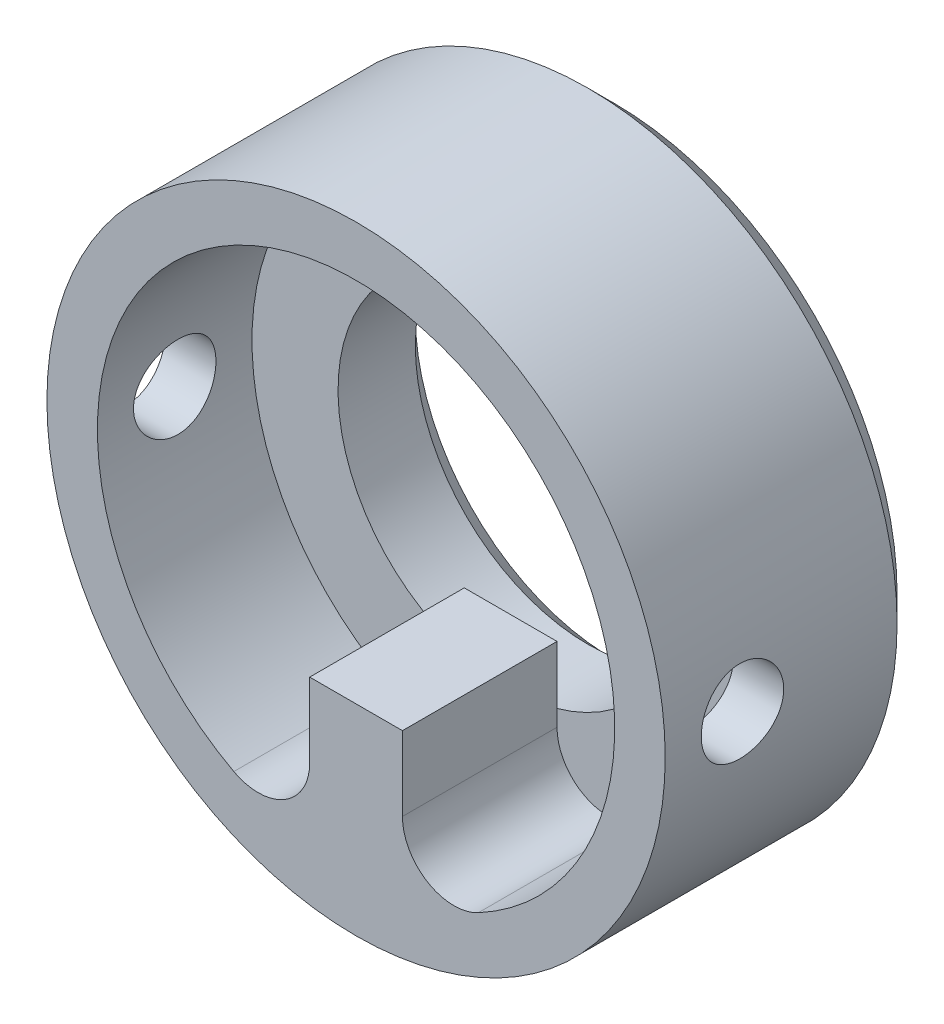
ISO-10303-21;
HEADER;
FILE_DESCRIPTION(('STEP AP214'),'2;1');
FILE_NAME('part.step','',(''),(''),'','','');
FILE_SCHEMA(('AUTOMOTIVE_DESIGN { 1 0 10303 214 1 1 1 1 }'));
ENDSEC;
DATA;
#1=APPLICATION_CONTEXT('core data for automotive mechanical design processes');
#2=APPLICATION_PROTOCOL_DEFINITION('international standard','automotive_design',2000,#1);
#3=PRODUCT_CONTEXT('',#1,'mechanical');
#4=PRODUCT('Part','Part','',(#3));
#5=PRODUCT_RELATED_PRODUCT_CATEGORY('part','',(#4));
#6=PRODUCT_DEFINITION_FORMATION('','',#4);
#7=PRODUCT_DEFINITION_CONTEXT('part definition',#1,'design');
#8=PRODUCT_DEFINITION('design','',#6,#7);
#9=PRODUCT_DEFINITION_SHAPE('','',#8);
#10=(LENGTH_UNIT() NAMED_UNIT(*) SI_UNIT(.MILLI.,.METRE.));
#11=(NAMED_UNIT(*) PLANE_ANGLE_UNIT() SI_UNIT($,.RADIAN.));
#12=(NAMED_UNIT(*) SI_UNIT($,.STERADIAN.) SOLID_ANGLE_UNIT());
#13=UNCERTAINTY_MEASURE_WITH_UNIT(LENGTH_MEASURE(1.E-05),#10,'distance_accuracy_value','');
#14=(GEOMETRIC_REPRESENTATION_CONTEXT(3) GLOBAL_UNCERTAINTY_ASSIGNED_CONTEXT((#13)) GLOBAL_UNIT_ASSIGNED_CONTEXT((#10,
#11,#12)) REPRESENTATION_CONTEXT('',''));
#15=CARTESIAN_POINT('',(0.,0.,0.));
#16=DIRECTION('',(0.,0.,1.));
#17=DIRECTION('',(1.,0.,0.));
#18=AXIS2_PLACEMENT_3D('',#15,#16,#17);
#19=CARTESIAN_POINT('',(0.,0.,0.));
#20=DIRECTION('',(0.,0.,1.));
#21=DIRECTION('',(1.,0.,0.));
#22=AXIS2_PLACEMENT_3D('',#19,#20,#21);
#23=CYLINDRICAL_SURFACE('',#22,3.35);
#24=CARTESIAN_POINT('',(0.,0.,-3.));
#25=DIRECTION('',(0.,0.,1.));
#26=DIRECTION('',(1.,0.,0.));
#27=AXIS2_PLACEMENT_3D('',#24,#25,#26);
#28=CIRCLE('',#27,3.35);
#29=CARTESIAN_POINT('',(-0.9,-3.22684056005251,-3.));
#30=VERTEX_POINT('',#29);
#31=CARTESIAN_POINT('',(0.899999999999999,-3.22684056005251,-3.));
#32=VERTEX_POINT('',#31);
#33=EDGE_CURVE('E65',#30,#32,#28,.F.);
#34=ORIENTED_EDGE('',*,*,#33,.F.);
#35=CARTESIAN_POINT('',(0.,0.,-3.));
#36=DIRECTION('',(0.,0.,1.));
#37=DIRECTION('',(1.,0.,0.));
#38=AXIS2_PLACEMENT_3D('',#35,#36,#37);
#39=CIRCLE('',#38,3.35);
#40=EDGE_CURVE('E19',#30,#32,#39,.T.);
#41=ORIENTED_EDGE('',*,*,#40,.T.);
#42=EDGE_LOOP('',(#34,#41));
#43=FACE_BOUND('',#42,.T.);
#44=CARTESIAN_POINT('',(0.,0.,-4.50000000000728));
#45=DIRECTION('',(0.,0.,-1.));
#46=DIRECTION('',(-1.,0.,0.));
#47=AXIS2_PLACEMENT_3D('',#44,#45,#46);
#48=CIRCLE('',#47,3.35000000001173);
#49=CARTESIAN_POINT('',(-3.35000000001173,0.,-4.50000000000728));
#50=VERTEX_POINT('',#49);
#51=EDGE_CURVE('E73',#50,#50,#48,.T.);
#52=ORIENTED_EDGE('',*,*,#51,.T.);
#53=EDGE_LOOP('',(#52));
#54=FACE_BOUND('',#53,.T.);
#55=ADVANCED_FACE('F16',(#43,#54),#23,.F.);
#56=CARTESIAN_POINT('',(0.,0.,-4.99999999999545));
#57=DIRECTION('',(0.,0.,-1.));
#58=DIRECTION('',(-1.,0.,0.));
#59=AXIS2_PLACEMENT_3D('',#56,#57,#58);
#60=CONICAL_SURFACE('',#59,3.84999999999991,0.785398163397448);
#61=ORIENTED_EDGE('',*,*,#51,.F.);
#62=EDGE_LOOP('',(#61));
#63=FACE_BOUND('',#62,.T.);
#64=CARTESIAN_POINT('',(0.,0.,-4.99999999999545));
#65=DIRECTION('',(0.,0.,-1.));
#66=DIRECTION('',(-1.,0.,0.));
#67=AXIS2_PLACEMENT_3D('',#64,#65,#66);
#68=CIRCLE('',#67,3.84999999999991);
#69=CARTESIAN_POINT('',(-3.84999999999991,0.,-4.99999999999545));
#70=VERTEX_POINT('',#69);
#71=EDGE_CURVE('E100',#70,#70,#68,.F.);
#72=ORIENTED_EDGE('',*,*,#71,.F.);
#73=EDGE_LOOP('',(#72));
#74=FACE_BOUND('',#73,.T.);
#75=ADVANCED_FACE('F245',(#63,#74),#60,.F.);
#76=CARTESIAN_POINT('',(3.35,0.,-3.));
#77=DIRECTION('',(0.,0.,1.));
#78=DIRECTION('',(1.,0.,0.));
#79=AXIS2_PLACEMENT_3D('',#76,#77,#78);
#80=PLANE('',#79);
#81=DIRECTION('',(0.,-1.,0.));
#82=VECTOR('',#81,1.);
#83=CARTESIAN_POINT('',(-0.9,-2.1,-3.));
#84=LINE('',#83,#82);
#85=CARTESIAN_POINT('',(-0.9,-2.1,-3.));
#86=VERTEX_POINT('',#85);
#87=EDGE_CURVE('E95',#86,#30,#84,.T.);
#88=ORIENTED_EDGE('',*,*,#87,.F.);
#89=DIRECTION('',(-1.,0.,0.));
#90=VECTOR('',#89,1.);
#91=CARTESIAN_POINT('',(-0.9,-2.1,-3.));
#92=LINE('',#91,#90);
#93=CARTESIAN_POINT('',(0.9,-2.1,-3.));
#94=VERTEX_POINT('',#93);
#95=EDGE_CURVE('E80',#94,#86,#92,.T.);
#96=ORIENTED_EDGE('',*,*,#95,.F.);
#97=DIRECTION('',(0.,1.,0.));
#98=VECTOR('',#97,1.);
#99=CARTESIAN_POINT('',(0.9,-2.1,-3.));
#100=LINE('',#99,#98);
#101=EDGE_CURVE('E76',#32,#94,#100,.T.);
#102=ORIENTED_EDGE('',*,*,#101,.F.);
#103=ORIENTED_EDGE('',*,*,#40,.F.);
#104=EDGE_LOOP('',(#88,#96,#102,#103));
#105=FACE_BOUND('',#104,.T.);
#106=ADVANCED_FACE('F78',(#105),#80,.F.);
#107=CARTESIAN_POINT('',(0.9,-2.1,-7.29534631898291));
#108=DIRECTION('',(1.,0.,0.));
#109=DIRECTION('',(0.,1.,0.));
#110=AXIS2_PLACEMENT_3D('',#107,#108,#109);
#111=PLANE('',#110);
#112=ORIENTED_EDGE('',*,*,#101,.T.);
#113=DIRECTION('',(0.,0.,1.));
#114=VECTOR('',#113,1.);
#115=CARTESIAN_POINT('',(0.9,-2.1,-7.29534631898291));
#116=LINE('',#115,#114);
#117=CARTESIAN_POINT('',(0.9,-2.1,0.));
#118=VERTEX_POINT('',#117);
#119=EDGE_CURVE('E171',#118,#94,#116,.F.);
#120=ORIENTED_EDGE('',*,*,#119,.F.);
#121=DIRECTION('',(0.,1.,0.));
#122=VECTOR('',#121,1.);
#123=CARTESIAN_POINT('',(0.9,-2.1,0.));
#124=LINE('',#123,#122);
#125=CARTESIAN_POINT('',(0.9,-3.54265437207752,0.));
#126=VERTEX_POINT('',#125);
#127=EDGE_CURVE('E72',#118,#126,#124,.F.);
#128=ORIENTED_EDGE('',*,*,#127,.T.);
#129=DIRECTION('',(0.,0.,1.));
#130=VECTOR('',#129,1.);
#131=CARTESIAN_POINT('',(0.9,-3.54265437207752,0.));
#132=LINE('',#131,#130);
#133=CARTESIAN_POINT('',(0.9,-3.54265437207752,-3.));
#134=VERTEX_POINT('',#133);
#135=EDGE_CURVE('E90',#126,#134,#132,.F.);
#136=ORIENTED_EDGE('',*,*,#135,.T.);
#137=DIRECTION('',(0.,1.,0.));
#138=VECTOR('',#137,1.);
#139=CARTESIAN_POINT('',(0.9,0.,-3.));
#140=LINE('',#139,#138);
#141=EDGE_CURVE('E87',#32,#134,#140,.F.);
#142=ORIENTED_EDGE('',*,*,#141,.F.);
#143=EDGE_LOOP('',(#112,#120,#128,#136,#142));
#144=FACE_BOUND('',#143,.T.);
#145=ADVANCED_FACE('F88',(#144),#111,.T.);
#146=CARTESIAN_POINT('',(-0.9,-2.1,-7.29534631898291));
#147=DIRECTION('',(-1.,0.,0.));
#148=DIRECTION('',(0.,-1.,0.));
#149=AXIS2_PLACEMENT_3D('',#146,#147,#148);
#150=PLANE('',#149);
#151=DIRECTION('',(0.,0.,1.));
#152=VECTOR('',#151,1.);
#153=CARTESIAN_POINT('',(-0.9,-2.1,-7.29534631898291));
#154=LINE('',#153,#152);
#155=CARTESIAN_POINT('',(-0.9,-2.1,0.));
#156=VERTEX_POINT('',#155);
#157=EDGE_CURVE('E173',#86,#156,#154,.T.);
#158=ORIENTED_EDGE('',*,*,#157,.F.);
#159=ORIENTED_EDGE('',*,*,#87,.T.);
#160=DIRECTION('',(0.,1.,0.));
#161=VECTOR('',#160,1.);
#162=CARTESIAN_POINT('',(-0.899999999999999,0.,-3.));
#163=LINE('',#162,#161);
#164=CARTESIAN_POINT('',(-0.899999999999999,-3.54265437207752,-3.));
#165=VERTEX_POINT('',#164);
#166=EDGE_CURVE('E94',#165,#30,#163,.T.);
#167=ORIENTED_EDGE('',*,*,#166,.F.);
#168=DIRECTION('',(0.,0.,1.));
#169=VECTOR('',#168,1.);
#170=CARTESIAN_POINT('',(-0.9,-3.54265437207752,0.));
#171=LINE('',#170,#169);
#172=CARTESIAN_POINT('',(-0.9,-3.54265437207752,0.));
#173=VERTEX_POINT('',#172);
#174=EDGE_CURVE('E111',#165,#173,#171,.T.);
#175=ORIENTED_EDGE('',*,*,#174,.T.);
#176=DIRECTION('',(0.,-1.,0.));
#177=VECTOR('',#176,1.);
#178=CARTESIAN_POINT('',(-0.9,-2.1,0.));
#179=LINE('',#178,#177);
#180=EDGE_CURVE('E84',#173,#156,#179,.F.);
#181=ORIENTED_EDGE('',*,*,#180,.T.);
#182=EDGE_LOOP('',(#158,#159,#167,#175,#181));
#183=FACE_BOUND('',#182,.T.);
#184=ADVANCED_FACE('F229',(#183),#150,.T.);
#185=CARTESIAN_POINT('',(3.35,0.,-3.));
#186=DIRECTION('',(0.,0.,1.));
#187=DIRECTION('',(1.,0.,0.));
#188=AXIS2_PLACEMENT_3D('',#185,#186,#187);
#189=PLANE('',#188);
#190=ORIENTED_EDGE('',*,*,#166,.T.);
#191=ORIENTED_EDGE('',*,*,#33,.T.);
#192=ORIENTED_EDGE('',*,*,#141,.T.);
#193=CARTESIAN_POINT('',(1.9,-3.54265437207752,-3.));
#194=DIRECTION('',(0.,0.,1.));
#195=DIRECTION('',(1.,0.,0.));
#196=AXIS2_PLACEMENT_3D('',#193,#194,#195);
#197=CIRCLE('',#196,1.);
#198=CARTESIAN_POINT('',(2.3726368159204,-4.42391167856447,-3.));
#199=VERTEX_POINT('',#198);
#200=EDGE_CURVE('E105',#134,#199,#197,.T.);
#201=ORIENTED_EDGE('',*,*,#200,.T.);
#202=CARTESIAN_POINT('',(0.,0.,-3.));
#203=DIRECTION('',(0.,0.,1.));
#204=DIRECTION('',(1.,0.,0.));
#205=AXIS2_PLACEMENT_3D('',#202,#203,#204);
#206=CIRCLE('',#205,5.02);
#207=CARTESIAN_POINT('',(-2.3726368159204,-4.42391167856447,-3.));
#208=VERTEX_POINT('',#207);
#209=EDGE_CURVE('E112',#199,#208,#206,.T.);
#210=ORIENTED_EDGE('',*,*,#209,.T.);
#211=CARTESIAN_POINT('',(-1.9,-3.54265437207752,-3.));
#212=DIRECTION('',(0.,0.,1.));
#213=DIRECTION('',(1.,0.,0.));
#214=AXIS2_PLACEMENT_3D('',#211,#212,#213);
#215=CIRCLE('',#214,1.);
#216=EDGE_CURVE('E108',#208,#165,#215,.T.);
#217=ORIENTED_EDGE('',*,*,#216,.T.);
#218=EDGE_LOOP('',(#190,#191,#192,#201,#210,#217));
#219=FACE_BOUND('',#218,.T.);
#220=ADVANCED_FACE('F98',(#219),#189,.T.);
#221=CARTESIAN_POINT('',(3.35,0.,-5.));
#222=DIRECTION('',(0.,0.,-1.));
#223=DIRECTION('',(-1.,0.,0.));
#224=AXIS2_PLACEMENT_3D('',#221,#222,#223);
#225=PLANE('',#224);
#226=CARTESIAN_POINT('',(0.,0.,-4.99999999999545));
#227=DIRECTION('',(0.,0.,1.));
#228=DIRECTION('',(1.,0.,0.));
#229=AXIS2_PLACEMENT_3D('',#226,#227,#228);
#230=CIRCLE('',#229,5.49999999998363);
#231=CARTESIAN_POINT('',(5.49999999998363,0.,-4.99999999999545));
#232=VERTEX_POINT('',#231);
#233=EDGE_CURVE('E115',#232,#232,#230,.T.);
#234=ORIENTED_EDGE('',*,*,#233,.F.);
#235=EDGE_LOOP('',(#234));
#236=FACE_BOUND('',#235,.T.);
#237=ORIENTED_EDGE('',*,*,#71,.T.);
#238=EDGE_LOOP('',(#237));
#239=FACE_BOUND('',#238,.T.);
#240=ADVANCED_FACE('F239',(#236,#239),#225,.T.);
#241=CARTESIAN_POINT('',(1.9,-3.54265437207752,0.));
#242=DIRECTION('',(0.,0.,1.));
#243=DIRECTION('',(1.,0.,0.));
#244=AXIS2_PLACEMENT_3D('',#241,#242,#243);
#245=CYLINDRICAL_SURFACE('',#244,1.);
#246=DIRECTION('',(0.,0.,1.));
#247=VECTOR('',#246,1.);
#248=CARTESIAN_POINT('',(2.3726368159204,-4.42391167856447,0.));
#249=LINE('',#248,#247);
#250=CARTESIAN_POINT('',(2.3726368159204,-4.42391167856447,0.));
#251=VERTEX_POINT('',#250);
#252=EDGE_CURVE('E107',#199,#251,#249,.T.);
#253=ORIENTED_EDGE('',*,*,#252,.F.);
#254=ORIENTED_EDGE('',*,*,#200,.F.);
#255=ORIENTED_EDGE('',*,*,#135,.F.);
#256=CARTESIAN_POINT('',(1.9,-3.54265437207752,0.));
#257=DIRECTION('',(0.,0.,1.));
#258=DIRECTION('',(1.,0.,0.));
#259=AXIS2_PLACEMENT_3D('',#256,#257,#258);
#260=CIRCLE('',#259,1.);
#261=EDGE_CURVE('E126',#251,#126,#260,.F.);
#262=ORIENTED_EDGE('',*,*,#261,.F.);
#263=EDGE_LOOP('',(#253,#254,#255,#262));
#264=FACE_BOUND('',#263,.T.);
#265=ADVANCED_FACE('F221',(#264),#245,.F.);
#266=CARTESIAN_POINT('',(-0.9,-2.1,-7.29534631898291));
#267=DIRECTION('',(0.,1.,0.));
#268=DIRECTION('',(-1.,0.,0.));
#269=AXIS2_PLACEMENT_3D('',#266,#267,#268);
#270=PLANE('',#269);
#271=DIRECTION('',(1.,0.,0.));
#272=VECTOR('',#271,1.);
#273=CARTESIAN_POINT('',(6.,-2.1,0.));
#274=LINE('',#273,#272);
#275=EDGE_CURVE('E176',#118,#156,#274,.F.);
#276=ORIENTED_EDGE('',*,*,#275,.F.);
#277=ORIENTED_EDGE('',*,*,#119,.T.);
#278=ORIENTED_EDGE('',*,*,#95,.T.);
#279=ORIENTED_EDGE('',*,*,#157,.T.);
#280=EDGE_LOOP('',(#276,#277,#278,#279));
#281=FACE_BOUND('',#280,.T.);
#282=ADVANCED_FACE('F225',(#281),#270,.T.);
#283=CARTESIAN_POINT('',(-1.9,-3.54265437207752,0.));
#284=DIRECTION('',(0.,0.,1.));
#285=DIRECTION('',(1.,0.,0.));
#286=AXIS2_PLACEMENT_3D('',#283,#284,#285);
#287=CYLINDRICAL_SURFACE('',#286,1.);
#288=DIRECTION('',(0.,0.,1.));
#289=VECTOR('',#288,1.);
#290=CARTESIAN_POINT('',(-2.3726368159204,-4.42391167856447,0.));
#291=LINE('',#290,#289);
#292=CARTESIAN_POINT('',(-2.3726368159204,-4.42391167856447,0.));
#293=VERTEX_POINT('',#292);
#294=EDGE_CURVE('E110',#208,#293,#291,.T.);
#295=ORIENTED_EDGE('',*,*,#294,.T.);
#296=CARTESIAN_POINT('',(-1.9,-3.54265437207752,0.));
#297=DIRECTION('',(0.,0.,1.));
#298=DIRECTION('',(1.,0.,0.));
#299=AXIS2_PLACEMENT_3D('',#296,#297,#298);
#300=CIRCLE('',#299,1.);
#301=EDGE_CURVE('E179',#173,#293,#300,.F.);
#302=ORIENTED_EDGE('',*,*,#301,.F.);
#303=ORIENTED_EDGE('',*,*,#174,.F.);
#304=ORIENTED_EDGE('',*,*,#216,.F.);
#305=EDGE_LOOP('',(#295,#302,#303,#304));
#306=FACE_BOUND('',#305,.T.);
#307=ADVANCED_FACE('F217',(#306),#287,.F.);
#308=CARTESIAN_POINT('',(0.,0.,0.));
#309=DIRECTION('',(0.,0.,1.));
#310=DIRECTION('',(1.,0.,0.));
#311=AXIS2_PLACEMENT_3D('',#308,#309,#310);
#312=CYLINDRICAL_SURFACE('',#311,5.02);
#313=CARTESIAN_POINT('',(5.02,-7.06249973853542E-13,-0.700000000000001));
#314=CARTESIAN_POINT('',(5.01999880635987,-0.044604158433175,-0.700003410795611));
#315=CARTESIAN_POINT('',(5.01939907804942,-0.0892411589900293,-0.703744127108045));
#316=CARTESIAN_POINT('',(5.01706195245648,-0.17731092599847,-0.71861522746566));
#317=CARTESIAN_POINT('',(5.01532223499229,-0.22074104781275,-0.729760682771658));
#318=CARTESIAN_POINT('',(5.0109008760423,-0.305044203216555,-0.75909740633306));
#319=CARTESIAN_POINT('',(5.00822037532252,-0.345920263385557,-0.777280144118385));
#320=CARTESIAN_POINT('',(5.00221341545229,-0.424024746868852,-0.820156245555085));
#321=CARTESIAN_POINT('',(4.99888720252927,-0.461254552482022,-0.844847128755654));
#322=CARTESIAN_POINT('',(4.99192458760986,-0.531358102220975,-0.900274295274037));
#323=CARTESIAN_POINT('',(4.98828592919895,-0.564194850402909,-0.931057092978286));
#324=CARTESIAN_POINT('',(4.98112582909102,-0.624261794275488,-0.99769559488205));
#325=CARTESIAN_POINT('',(4.97760440054482,-0.65149136271863,-1.03355186586986));
#326=CARTESIAN_POINT('',(4.97105617095738,-0.699712869011842,-1.10956588781237));
#327=CARTESIAN_POINT('',(4.9680322381163,-0.720669171012628,-1.14974651387836));
#328=CARTESIAN_POINT('',(4.96285201028244,-0.755521212092943,-1.23311334573765));
#329=CARTESIAN_POINT('',(4.96069565429673,-0.769417447531562,-1.27629933999529));
#330=CARTESIAN_POINT('',(4.9575167447298,-0.789640857062606,-1.36406563888245));
#331=CARTESIAN_POINT('',(4.95648478906824,-0.796030833211808,-1.40863112555851));
#332=CARTESIAN_POINT('',(4.9556430371952,-0.801254977612822,-1.49821288392068));
#333=CARTESIAN_POINT('',(4.95583316391764,-0.800089622313389,-1.54322912700278));
#334=CARTESIAN_POINT('',(4.95740550167707,-0.790287432886664,-1.63198786764917));
#335=CARTESIAN_POINT('',(4.95877648909568,-0.781720941316058,-1.67573836122442));
#336=CARTESIAN_POINT('',(4.96253853819198,-0.757469797979429,-1.761173378241));
#337=CARTESIAN_POINT('',(4.96492964059043,-0.741784862059078,-1.80285781913588));
#338=CARTESIAN_POINT('',(4.97047484217983,-0.703669306833854,-1.88319049237456));
#339=CARTESIAN_POINT('',(4.97363228757423,-0.681208995714378,-1.92182439632193));
#340=CARTESIAN_POINT('',(4.98035172587783,-0.630203320301891,-1.99479861091701));
#341=CARTESIAN_POINT('',(4.9839137171753,-0.6016579802516,-2.02913893866944));
#342=CARTESIAN_POINT('',(4.99108989951086,-0.538913333112026,-2.09295612105156));
#343=CARTESIAN_POINT('',(4.99470423035595,-0.504654646880806,-2.12237460628191));
#344=CARTESIAN_POINT('',(5.00154280727612,-0.431638662107157,-2.17506704542335));
#345=CARTESIAN_POINT('',(5.00476687772498,-0.392879353439655,-2.1983382384389));
#346=CARTESIAN_POINT('',(5.01046619895827,-0.311894668623039,-2.2380786875332));
#347=CARTESIAN_POINT('',(5.01294030001169,-0.269664095611585,-2.25453751397382));
#348=CARTESIAN_POINT('',(5.01684741928271,-0.183059156786303,-2.28007699104417));
#349=CARTESIAN_POINT('',(5.01828263332935,-0.13868952528304,-2.28917320839181));
#350=CARTESIAN_POINT('',(5.01970548610776,-0.0627387393492459,-2.29815534079231));
#351=CARTESIAN_POINT('',(5.0200008396849,-0.0313774958671711,-2.30000239937772));
#352=CARTESIAN_POINT('',(5.01999880635987,0.044604158432466,-2.29999658920443));
#353=CARTESIAN_POINT('',(5.01939907804943,0.0892411589893228,-2.29625587289204));
#354=CARTESIAN_POINT('',(5.0170619524565,0.177310925997775,-2.2813847725345));
#355=CARTESIAN_POINT('',(5.01532223499232,0.220741047812064,-2.27023931722854));
#356=CARTESIAN_POINT('',(5.01090087604234,0.305044203215894,-2.24090259366721));
#357=CARTESIAN_POINT('',(5.00822037532257,0.345920263384911,-2.22271985588193));
#358=CARTESIAN_POINT('',(5.00221341545235,0.424024746868243,-2.1798437544453));
#359=CARTESIAN_POINT('',(4.99888720252932,0.461254552481434,-2.15515287124476));
#360=CARTESIAN_POINT('',(4.99192458760992,0.531358102220435,-2.09972570472644));
#361=CARTESIAN_POINT('',(4.98828592919901,0.564194850402396,-2.06894290702222));
#362=CARTESIAN_POINT('',(4.98112582909108,0.624261794275033,-2.00230440511851));
#363=CARTESIAN_POINT('',(4.97760440054488,0.651491362718206,-1.96644813413073));
#364=CARTESIAN_POINT('',(4.97105617095743,0.699712869011487,-1.89043411218826));
#365=CARTESIAN_POINT('',(4.96803223811635,0.720669171012309,-1.8502534861223));
#366=CARTESIAN_POINT('',(4.96285201028247,0.755521212092699,-1.76688665426304));
#367=CARTESIAN_POINT('',(4.96069565429677,0.769417447531358,-1.72370066000541));
#368=CARTESIAN_POINT('',(4.95751674472982,0.789640857062481,-1.63593436111827));
#369=CARTESIAN_POINT('',(4.95648478906826,0.796030833211724,-1.59136887444221));
#370=CARTESIAN_POINT('',(4.9556430371952,0.801254977612819,-1.50178711608004));
#371=CARTESIAN_POINT('',(4.95583316391764,0.800089622313426,-1.45677087299794));
#372=CARTESIAN_POINT('',(4.95740550167705,0.79028743288678,-1.36801213235154));
#373=CARTESIAN_POINT('',(4.95877648909565,0.781720941316214,-1.32426163877628));
#374=CARTESIAN_POINT('',(4.96253853819194,0.757469797979661,-1.23882662175968));
#375=CARTESIAN_POINT('',(4.96492964059039,0.741784862059346,-1.19714218086478));
#376=CARTESIAN_POINT('',(4.97047484217978,0.703669306834194,-1.11680950762607));
#377=CARTESIAN_POINT('',(4.97363228757418,0.681208995714753,-1.07817560367868));
#378=CARTESIAN_POINT('',(4.98035172587777,0.630203320302333,-1.00520138908356));
#379=CARTESIAN_POINT('',(4.98391371717524,0.601657980252073,-0.970861061331104));
#380=CARTESIAN_POINT('',(4.99108989951081,0.538913333112558,-0.907043878948925));
#381=CARTESIAN_POINT('',(4.99470423035589,0.504654646881365,-0.877625393718545));
#382=CARTESIAN_POINT('',(5.00154280727607,0.431638662107766,-0.824932954577045));
#383=CARTESIAN_POINT('',(5.00476687772493,0.392879353440286,-0.801661761561457));
#384=CARTESIAN_POINT('',(5.01046619895823,0.311894668623706,-0.761921312467087));
#385=CARTESIAN_POINT('',(5.01294030001166,0.269664095612267,-0.745462486026428));
#386=CARTESIAN_POINT('',(5.01684741928269,0.183059156787008,-0.719923008955997));
#387=CARTESIAN_POINT('',(5.01828263332933,0.138689525283753,-0.710826791608315));
#388=CARTESIAN_POINT('',(5.01970548610776,0.0627387393494921,-0.701844659207695));
#389=CARTESIAN_POINT('',(5.0200008396849,0.0313774958669399,-0.699997600622254));
#390=CARTESIAN_POINT('',(5.02,-7.06249973853542E-13,-0.700000000000001));
#391=B_SPLINE_CURVE_WITH_KNOTS('',3,(#313,#314,#315,#316,#317,#318,#319,#320,#321,#322,#323,
#324,#325,#326,#327,#328,#329,#330,#331,#332,#333,#334,#335,#336,#337,#338,#339,#340,#341,#342,
#343,#344,#345,#346,#347,#348,#349,#350,#351,#352,#353,#354,#355,#356,#357,#358,#359,#360,#361,
#362,#363,#364,#365,#366,#367,#368,#369,#370,#371,#372,#373,#374,#375,#376,#377,#378,#379,#380,
#381,#382,#383,#384,#385,#386,#387,#388,#389,#390),.UNSPECIFIED.,.T.,.F.,(4,2,2,2,2,2,2,2,2,2,2,
2,2,2,2,2,2,2,2,2,2,2,2,2,2,2,2,2,2,2,2,2,2,2,2,2,2,2,4),(0.,0.133710427726158,
0.267693840601087,0.40151534726112,0.535285924066382,0.670120307814192,0.804969766634569,
0.940571315192765,1.07616332894305,1.21061262729515,1.34505344718696,1.47823038549483,
1.61141264043236,1.74518723634732,1.87896129931505,2.01422391034037,2.1495471681389,
2.28507684439347,2.42031921706246,2.51437991769707,2.64809034542322,2.78207375829815,
2.91589526495818,3.04966584176344,3.18450022551124,3.31934968433161,3.45495123288981,
3.5905432466401,3.7249925449922,3.85943336488401,3.99261030319188,4.12579255812942,
4.25956715404438,4.3933412170121,4.52860382803742,4.66392708583595,4.79945676209052,
4.93469913475951,5.02875983539554),.UNSPECIFIED.);
#392=CARTESIAN_POINT('',(5.02,-7.06249973853542E-13,-0.700000000000001));
#393=VERTEX_POINT('',#392);
#394=EDGE_CURVE('E118',#393,#393,#391,.T.);
#395=ORIENTED_EDGE('',*,*,#394,.T.);
#396=EDGE_LOOP('',(#395));
#397=FACE_BOUND('',#396,.T.);
#398=CARTESIAN_POINT('',(-5.02,0.,-2.3));
#399=CARTESIAN_POINT('',(-5.01999880635987,-0.0446041584324662,-2.29999658920443));
#400=CARTESIAN_POINT('',(-5.01939907804943,-0.089241158989323,-2.29625587289204));
#401=CARTESIAN_POINT('',(-5.0170619524565,-0.177310925997776,-2.2813847725345));
#402=CARTESIAN_POINT('',(-5.01532223499232,-0.220741047812065,-2.27023931722854));
#403=CARTESIAN_POINT('',(-5.01090087604234,-0.305044203215895,-2.24090259366721));
#404=CARTESIAN_POINT('',(-5.00822037532257,-0.345920263384912,-2.22271985588193));
#405=CARTESIAN_POINT('',(-5.00221341545235,-0.424024746868244,-2.1798437544453));
#406=CARTESIAN_POINT('',(-4.99888720252932,-0.461254552481435,-2.15515287124476));
#407=CARTESIAN_POINT('',(-4.99192458760992,-0.531358102220436,-2.09972570472644));
#408=CARTESIAN_POINT('',(-4.98828592919901,-0.564194850402397,-2.06894290702222));
#409=CARTESIAN_POINT('',(-4.98112582909108,-0.624261794275034,-2.00230440511852));
#410=CARTESIAN_POINT('',(-4.97760440054488,-0.651491362718208,-1.96644813413073));
#411=CARTESIAN_POINT('',(-4.97105617095743,-0.699712869011488,-1.89043411218826));
#412=CARTESIAN_POINT('',(-4.96803223811635,-0.72066917101231,-1.8502534861223));
#413=CARTESIAN_POINT('',(-4.96285201028247,-0.755521212092701,-1.76688665426304));
#414=CARTESIAN_POINT('',(-4.96069565429677,-0.769417447531359,-1.72370066000541));
#415=CARTESIAN_POINT('',(-4.95751674472982,-0.789640857062483,-1.63593436111827));
#416=CARTESIAN_POINT('',(-4.95648478906825,-0.796030833211726,-1.59136887444221));
#417=CARTESIAN_POINT('',(-4.9556430371952,-0.801254977612821,-1.50178711608005));
#418=CARTESIAN_POINT('',(-4.95583316391764,-0.800089622313428,-1.45677087299794));
#419=CARTESIAN_POINT('',(-4.95740550167705,-0.790287432886782,-1.36801213235154));
#420=CARTESIAN_POINT('',(-4.95877648909565,-0.781720941316216,-1.32426163877629));
#421=CARTESIAN_POINT('',(-4.96253853819194,-0.757469797979663,-1.23882662175968));
#422=CARTESIAN_POINT('',(-4.96492964059039,-0.741784862059348,-1.19714218086478));
#423=CARTESIAN_POINT('',(-4.97047484217978,-0.703669306834196,-1.11680950762607));
#424=CARTESIAN_POINT('',(-4.97363228757418,-0.681208995714755,-1.07817560367868));
#425=CARTESIAN_POINT('',(-4.98035172587777,-0.630203320302335,-1.00520138908356));
#426=CARTESIAN_POINT('',(-4.98391371717524,-0.601657980252075,-0.970861061331105));
#427=CARTESIAN_POINT('',(-4.9910898995108,-0.538913333112561,-0.907043878948926));
#428=CARTESIAN_POINT('',(-4.99470423035589,-0.504654646881368,-0.877625393718545));
#429=CARTESIAN_POINT('',(-5.00154280727607,-0.431638662107768,-0.824932954577045));
#430=CARTESIAN_POINT('',(-5.00476687772493,-0.392879353440289,-0.801661761561457));
#431=CARTESIAN_POINT('',(-5.01046619895823,-0.311894668623709,-0.761921312467088));
#432=CARTESIAN_POINT('',(-5.01294030001166,-0.26966409561227,-0.745462486026429));
#433=CARTESIAN_POINT('',(-5.01684741928269,-0.183059156787011,-0.719923008955998));
#434=CARTESIAN_POINT('',(-5.01828263332933,-0.138689525283756,-0.710826791608316));
#435=CARTESIAN_POINT('',(-5.01970548610777,-0.0627387393491823,-0.701844659207657));
#436=CARTESIAN_POINT('',(-5.02000083968491,-0.0313774958663131,-0.699997600622216));
#437=CARTESIAN_POINT('',(-5.01999880635986,0.0446041584341187,-0.700003410795663));
#438=CARTESIAN_POINT('',(-5.0193990780494,0.0892411589909699,-0.70374412710815));
#439=CARTESIAN_POINT('',(-5.01706195245644,0.177310925999395,-0.71861522746587));
#440=CARTESIAN_POINT('',(-5.01532223499225,0.220741047813662,-0.72976068277192));
#441=CARTESIAN_POINT('',(-5.01090087604224,0.305044203217434,-0.759097406333423));
#442=CARTESIAN_POINT('',(-5.00822037532246,0.345920263386416,-0.777280144118796));
#443=CARTESIAN_POINT('',(-5.00221341545223,0.424024746869662,-0.820156245555591));
#444=CARTESIAN_POINT('',(-4.9988872025292,0.461254552482803,-0.844847128756205));
#445=CARTESIAN_POINT('',(-4.99192458760979,0.531358102221692,-0.900274295274674));
#446=CARTESIAN_POINT('',(-4.98828592919888,0.56419485040359,-0.931057092978964));
#447=CARTESIAN_POINT('',(-4.98112582909095,0.624261794276092,-0.997695594882803));
#448=CARTESIAN_POINT('',(-4.97760440054475,0.651491362719192,-1.03355186587065));
#449=CARTESIAN_POINT('',(-4.97105617095732,0.699712869012313,-1.10956588781322));
#450=CARTESIAN_POINT('',(-4.96803223811624,0.72066917101305,-1.14974651387923));
#451=CARTESIAN_POINT('',(-4.96285201028239,0.755521212093264,-1.23311334573856));
#452=CARTESIAN_POINT('',(-4.96069565429669,0.769417447531831,-1.27629933999622));
#453=CARTESIAN_POINT('',(-4.95751674472977,0.789640857062769,-1.3640656388834));
#454=CARTESIAN_POINT('',(-4.95648478906822,0.796030833211916,-1.40863112555947));
#455=CARTESIAN_POINT('',(-4.9556430371952,0.801254977612823,-1.49821288392164));
#456=CARTESIAN_POINT('',(-4.95583316391765,0.800089622313335,-1.54322912700374));
#457=CARTESIAN_POINT('',(-4.95740550167709,0.790287432886504,-1.63198786765012));
#458=CARTESIAN_POINT('',(-4.95877648909571,0.781720941315847,-1.67573836122535));
#459=CARTESIAN_POINT('',(-4.96253853819203,0.757469797979116,-1.7611733782419));
#460=CARTESIAN_POINT('',(-4.96492964059049,0.741784862058716,-1.80285781913677));
#461=CARTESIAN_POINT('',(-4.9704748421799,0.703669306833395,-1.8831904923754));
#462=CARTESIAN_POINT('',(-4.9736322875743,0.681208995713873,-1.92182439632274));
#463=CARTESIAN_POINT('',(-4.98035172587791,0.630203320301297,-1.99479861091776));
#464=CARTESIAN_POINT('',(-4.98391371717538,0.601657980250963,-2.02913893867016));
#465=CARTESIAN_POINT('',(-4.99108989951094,0.538913333111311,-2.09295612105221));
#466=CARTESIAN_POINT('',(-4.99470423035603,0.504654646880054,-2.12237460628252));
#467=CARTESIAN_POINT('',(-5.00154280727619,0.431638662106339,-2.17506704542387));
#468=CARTESIAN_POINT('',(-5.00476687772504,0.392879353438807,-2.19833823843938));
#469=CARTESIAN_POINT('',(-5.01046619895832,0.311894668622142,-2.23807868753358));
#470=CARTESIAN_POINT('',(-5.01294030001174,0.269664095610668,-2.25453751397414));
#471=CARTESIAN_POINT('',(-5.01684741928275,0.183059156785357,-2.28007699104439));
#472=CARTESIAN_POINT('',(-5.01828263332938,0.138689525282084,-2.28917320839198));
#473=CARTESIAN_POINT('',(-5.01970548610777,0.0627387393486006,-2.29815534079235));
#474=CARTESIAN_POINT('',(-5.02000083968489,0.031377495866848,-2.30000239937772));
#475=CARTESIAN_POINT('',(-5.02,0.,-2.3));
#476=B_SPLINE_CURVE_WITH_KNOTS('',3,(#398,#399,#400,#401,#402,#403,#404,#405,#406,#407,#408,
#409,#410,#411,#412,#413,#414,#415,#416,#417,#418,#419,#420,#421,#422,#423,#424,#425,#426,#427,
#428,#429,#430,#431,#432,#433,#434,#435,#436,#437,#438,#439,#440,#441,#442,#443,#444,#445,#446,
#447,#448,#449,#450,#451,#452,#453,#454,#455,#456,#457,#458,#459,#460,#461,#462,#463,#464,#465,
#466,#467,#468,#469,#470,#471,#472,#473,#474,#475),.UNSPECIFIED.,.T.,.F.,(4,2,2,2,2,2,2,2,2,2,2,
2,2,2,2,2,2,2,2,2,2,2,2,2,2,2,2,2,2,2,2,2,2,2,2,2,2,2,4),(0.,0.133710427726153,0.26769384060108,
0.40151534726111,0.535285924066369,0.670120307814174,0.804969766634548,0.940571315192744,
1.07616332894303,1.21061262729513,1.34505344718695,1.47823038549482,1.61141264043235,
1.74518723634731,1.87896129931503,2.01422391034035,2.14954716813888,2.28507684439345,
2.42031921706244,2.51437991769942,2.64809034542558,2.78207375830051,2.91589526496055,
3.04966584176582,3.18450022551363,3.31934968433401,3.45495123289221,3.5905432466425,
3.72499254499459,3.85943336488639,3.99261030319426,4.12579255813178,4.25956715404675,
4.39334121701449,4.52860382803981,4.66392708583835,4.79945676209292,4.9346991347619,
5.02875983539554),.UNSPECIFIED.);
#477=CARTESIAN_POINT('',(-5.02,0.,-2.3));
#478=VERTEX_POINT('',#477);
#479=EDGE_CURVE('E151',#478,#478,#476,.T.);
#480=ORIENTED_EDGE('',*,*,#479,.T.);
#481=EDGE_LOOP('',(#480));
#482=FACE_BOUND('',#481,.T.);
#483=ORIENTED_EDGE('',*,*,#209,.F.);
#484=ORIENTED_EDGE('',*,*,#252,.T.);
#485=CARTESIAN_POINT('',(0.,0.,0.));
#486=DIRECTION('',(0.,0.,1.));
#487=DIRECTION('',(1.,0.,0.));
#488=AXIS2_PLACEMENT_3D('',#485,#486,#487);
#489=CIRCLE('',#488,5.02);
#490=EDGE_CURVE('E34',#293,#251,#489,.F.);
#491=ORIENTED_EDGE('',*,*,#490,.F.);
#492=ORIENTED_EDGE('',*,*,#294,.F.);
#493=EDGE_LOOP('',(#483,#484,#491,#492));
#494=FACE_BOUND('',#493,.T.);
#495=ADVANCED_FACE('F128',(#397,#482,#494),#312,.F.);
#496=CARTESIAN_POINT('',(0.,0.,-4.50000000012096));
#497=DIRECTION('',(0.,0.,1.));
#498=DIRECTION('',(1.,0.,0.));
#499=AXIS2_PLACEMENT_3D('',#496,#497,#498);
#500=CONICAL_SURFACE('',#499,5.99999999985812,0.785398163397448);
#501=ORIENTED_EDGE('',*,*,#233,.T.);
#502=EDGE_LOOP('',(#501));
#503=FACE_BOUND('',#502,.T.);
#504=CARTESIAN_POINT('',(0.,0.,-4.5));
#505=DIRECTION('',(0.,0.,1.));
#506=DIRECTION('',(1.,0.,0.));
#507=AXIS2_PLACEMENT_3D('',#504,#505,#506);
#508=CIRCLE('',#507,6.);
#509=CARTESIAN_POINT('',(6.,0.,-4.5));
#510=VERTEX_POINT('',#509);
#511=EDGE_CURVE('E150',#510,#510,#508,.T.);
#512=ORIENTED_EDGE('',*,*,#511,.F.);
#513=EDGE_LOOP('',(#512));
#514=FACE_BOUND('',#513,.T.);
#515=ADVANCED_FACE('F137',(#503,#514),#500,.T.);
#516=CARTESIAN_POINT('',(-6.,0.,-1.5));
#517=DIRECTION('',(1.,0.,0.));
#518=DIRECTION('',(0.,0.,-1.));
#519=AXIS2_PLACEMENT_3D('',#516,#517,#518);
#520=CYLINDRICAL_SURFACE('',#519,0.8);
#521=ORIENTED_EDGE('',*,*,#394,.F.);
#522=EDGE_LOOP('',(#521));
#523=FACE_BOUND('',#522,.T.);
#524=CARTESIAN_POINT('',(6.,0.,-2.3));
#525=CARTESIAN_POINT('',(5.99999895312369,-0.0446954061875742,-2.29999648064289));
#526=CARTESIAN_POINT('',(5.99949511871908,-0.0894260657103654,-2.29624053118422));
#527=CARTESIAN_POINT('',(5.9975316768628,-0.177684582741286,-2.28130564009724));
#528=CARTESIAN_POINT('',(5.99607009069471,-0.221209755253075,-2.27011133013283));
#529=CARTESIAN_POINT('',(5.99235606266934,-0.305704248730251,-2.24063737068994));
#530=CARTESIAN_POINT('',(5.99010449140212,-0.346676324997805,-2.22236551860426));
#531=CARTESIAN_POINT('',(5.98506086433767,-0.424954869838674,-2.17927113154072));
#532=CARTESIAN_POINT('',(5.98226902920835,-0.462262825655445,-2.15445126956423));
#533=CARTESIAN_POINT('',(5.97643605094211,-0.532409415906074,-2.09879539171327));
#534=CARTESIAN_POINT('',(5.97339358519048,-0.565221537012255,-2.06792609398546));
#535=CARTESIAN_POINT('',(5.96741269849513,-0.625217582959481,-2.0011177319069));
#536=CARTESIAN_POINT('',(5.96447428830312,-0.652400927596744,-1.96517814556159));
#537=CARTESIAN_POINT('',(5.95902172956165,-0.700463713587189,-1.88908018238001));
#538=CARTESIAN_POINT('',(5.95650924904497,-0.721318612132428,-1.8489061747046));
#539=CARTESIAN_POINT('',(5.95221033387962,-0.755975501268691,-1.76558719591401));
#540=CARTESIAN_POINT('',(5.95042386163453,-0.769777857085825,-1.72244237877782));
#541=CARTESIAN_POINT('',(5.94779174741929,-0.789858418274183,-1.63467771384273));
#542=CARTESIAN_POINT('',(5.94694058294766,-0.796180806113905,-1.59006814355295));
#543=CARTESIAN_POINT('',(5.94625860616459,-0.80125872419714,-1.50041360606975));
#544=CARTESIAN_POINT('',(5.94642774910737,-0.800014586272079,-1.4553686580564));
#545=CARTESIAN_POINT('',(5.94776222019556,-0.790031005980458,-1.36643174091177));
#546=CARTESIAN_POINT('',(5.94892104841297,-0.78134046790743,-1.32253417059105));
#547=CARTESIAN_POINT('',(5.95209419344266,-0.756787035135927,-1.23682563107186));
#548=CARTESIAN_POINT('',(5.95410853720291,-0.740923914506565,-1.19501472764788));
#549=CARTESIAN_POINT('',(5.95877313865078,-0.702422949178316,-1.11451452596228));
#550=CARTESIAN_POINT('',(5.96142539112763,-0.679763796750429,-1.07583553890803));
#551=CARTESIAN_POINT('',(5.96706518449431,-0.628331226687752,-1.00281359977419));
#552=CARTESIAN_POINT('',(5.97005271591496,-0.599557981710886,-0.968470525294939));
#553=CARTESIAN_POINT('',(5.97605491882451,-0.536449238479343,-0.904814021016245));
#554=CARTESIAN_POINT('',(5.97906962233567,-0.502072664251772,-0.875541304206296));
#555=CARTESIAN_POINT('',(5.98476646339783,-0.428854890092129,-0.823161693340682));
#556=CARTESIAN_POINT('',(5.98744844905425,-0.390011666494179,-0.800057609925741));
#557=CARTESIAN_POINT('',(5.99218008264182,-0.308916258421148,-0.760671824393159));
#558=CARTESIAN_POINT('',(5.99422895472309,-0.266659970722088,-0.744398484339889));
#559=CARTESIAN_POINT('',(5.99745357570346,-0.180050368707187,-0.719225944646041));
#560=CARTESIAN_POINT('',(5.99863117103123,-0.135701702160384,-0.710311145958094));
#561=CARTESIAN_POINT('',(5.99976900453821,-0.0607603105614702,-0.701729815991147));
#562=CARTESIAN_POINT('',(6.00000071176879,-0.030388303399168,-0.699997607197212));
#563=CARTESIAN_POINT('',(5.99999895312369,0.0446954061880531,-0.700003519357141));
#564=CARTESIAN_POINT('',(5.99949511871907,0.0894260657108424,-0.703759468815837));
#565=CARTESIAN_POINT('',(5.99753167686279,0.177684582741755,-0.718694359902864));
#566=CARTESIAN_POINT('',(5.99607009069469,0.221209755253537,-0.729888669867302));
#567=CARTESIAN_POINT('',(5.99235606266932,0.305704248730696,-0.759362629310251));
#568=CARTESIAN_POINT('',(5.9901044914021,0.34667632499824,-0.777634481395946));
#569=CARTESIAN_POINT('',(5.98506086433764,0.424954869839083,-0.82072886845954));
#570=CARTESIAN_POINT('',(5.98226902920832,0.46226282565584,-0.845548730436049));
#571=CARTESIAN_POINT('',(5.97643605094208,0.532409415906436,-0.90120460828706));
#572=CARTESIAN_POINT('',(5.97339358519045,0.565221537012598,-0.932073906014887));
#573=CARTESIAN_POINT('',(5.9674126984951,0.625217582959784,-0.998882268093478));
#574=CARTESIAN_POINT('',(5.96447428830309,0.652400927597026,-1.03482185443881));
#575=CARTESIAN_POINT('',(5.95902172956162,0.700463713587425,-1.11091981762042));
#576=CARTESIAN_POINT('',(5.95650924904495,0.721318612132639,-1.15109382529585));
#577=CARTESIAN_POINT('',(5.9522103338796,0.755975501268852,-1.23441280408645));
#578=CARTESIAN_POINT('',(5.95042386163451,0.769777857085959,-1.27755762122265));
#579=CARTESIAN_POINT('',(5.94779174741927,0.789858418274264,-1.36532228615776));
#580=CARTESIAN_POINT('',(5.94694058294765,0.796180806113958,-1.40993185644754));
#581=CARTESIAN_POINT('',(5.94625860616459,0.801258724197139,-1.49958639393074));
#582=CARTESIAN_POINT('',(5.94642774910737,0.80001458627205,-1.54463134194409));
#583=CARTESIAN_POINT('',(5.94776222019558,0.790031005980375,-1.63356825908871));
#584=CARTESIAN_POINT('',(5.94892104841298,0.781340467907321,-1.67746582940942));
#585=CARTESIAN_POINT('',(5.95209419344268,0.756787035135767,-1.7631743689286));
#586=CARTESIAN_POINT('',(5.95410853720294,0.740923914506379,-1.80498527235257));
#587=CARTESIAN_POINT('',(5.95877313865081,0.702422949178081,-1.88548547403815));
#588=CARTESIAN_POINT('',(5.96142539112766,0.679763796750171,-1.92416446109238));
#589=CARTESIAN_POINT('',(5.96706518449434,0.62833122668745,-1.99718640022619));
#590=CARTESIAN_POINT('',(5.970052715915,0.599557981710562,-2.03152947470543));
#591=CARTESIAN_POINT('',(5.97605491882454,0.53644923847898,-2.09518597898408));
#592=CARTESIAN_POINT('',(5.9790696223357,0.50207266425139,-2.12445869579401));
#593=CARTESIAN_POINT('',(5.98476646339786,0.428854890091715,-2.17683830665958));
#594=CARTESIAN_POINT('',(5.98744844905428,0.39001166649375,-2.1999423900745));
#595=CARTESIAN_POINT('',(5.99218008264184,0.308916258420694,-2.23932817560703));
#596=CARTESIAN_POINT('',(5.99422895472312,0.266659970721625,-2.25560151566028));
#597=CARTESIAN_POINT('',(5.99745357570348,0.180050368706708,-2.28077405535407));
#598=CARTESIAN_POINT('',(5.99863117103124,0.1357017021599,-2.28968885404199));
#599=CARTESIAN_POINT('',(5.99976900453821,0.0607603105613024,-2.29827018400885));
#600=CARTESIAN_POINT('',(6.00000071176879,0.0303883033993235,-2.30000239280277));
#601=CARTESIAN_POINT('',(6.,0.,-2.3));
#602=B_SPLINE_CURVE_WITH_KNOTS('',3,(#524,#525,#526,#527,#528,#529,#530,#531,#532,#533,#534,
#535,#536,#537,#538,#539,#540,#541,#542,#543,#544,#545,#546,#547,#548,#549,#550,#551,#552,#553,
#554,#555,#556,#557,#558,#559,#560,#561,#562,#563,#564,#565,#566,#567,#568,#569,#570,#571,#572,
#573,#574,#575,#576,#577,#578,#579,#580,#581,#582,#583,#584,#585,#586,#587,#588,#589,#590,#591,
#592,#593,#594,#595,#596,#597,#598,#599,#600,#601),.UNSPECIFIED.,.T.,.F.,(4,2,2,2,2,2,2,2,2,2,2,
2,2,2,2,2,2,2,2,2,2,2,2,2,2,2,2,2,2,2,2,2,2,2,2,2,2,2,4),(0.,0.13398843784812,0.268254572478556,
0.402373203690005,0.536437170039014,0.671260535497147,0.806097791385842,0.941451476213213,
1.07679815084396,1.21134130734763,1.34587856347815,1.47953895873857,1.61320356449297,
1.74729171202266,1.88137607349498,2.01649164277504,2.15166867068216,2.28701070046069,
2.42206508241703,2.51316351173403,2.64715194958215,2.78141808421259,2.91553671542404,
3.04960068177305,3.18442404723119,3.31926130311988,3.45461498794725,3.589961662578,
3.72450481908166,3.85904207521219,3.99270247047261,4.12636707622701,4.2604552237567,
4.39453958522902,4.52965515450908,4.6648321824162,4.80017421219473,4.93522859415107,
5.02632702346711),.UNSPECIFIED.);
#603=CARTESIAN_POINT('',(6.,0.,-2.3));
#604=VERTEX_POINT('',#603);
#605=EDGE_CURVE('E142',#604,#604,#602,.T.);
#606=ORIENTED_EDGE('',*,*,#605,.F.);
#607=EDGE_LOOP('',(#606));
#608=FACE_BOUND('',#607,.T.);
#609=ADVANCED_FACE('F132',(#523,#608),#520,.F.);
#610=CARTESIAN_POINT('',(6.,0.,0.));
#611=DIRECTION('',(0.,0.,1.));
#612=DIRECTION('',(1.,0.,0.));
#613=AXIS2_PLACEMENT_3D('',#610,#611,#612);
#614=PLANE('',#613);
#615=ORIENTED_EDGE('',*,*,#301,.T.);
#616=ORIENTED_EDGE('',*,*,#490,.T.);
#617=ORIENTED_EDGE('',*,*,#261,.T.);
#618=ORIENTED_EDGE('',*,*,#127,.F.);
#619=ORIENTED_EDGE('',*,*,#275,.T.);
#620=ORIENTED_EDGE('',*,*,#180,.F.);
#621=EDGE_LOOP('',(#615,#616,#617,#618,#619,#620));
#622=FACE_BOUND('',#621,.T.);
#623=CARTESIAN_POINT('',(0.,0.,0.));
#624=DIRECTION('',(0.,0.,1.));
#625=DIRECTION('',(1.,0.,0.));
#626=AXIS2_PLACEMENT_3D('',#623,#624,#625);
#627=CIRCLE('',#626,6.);
#628=CARTESIAN_POINT('',(6.,0.,0.));
#629=VERTEX_POINT('',#628);
#630=EDGE_CURVE('E25',#629,#629,#627,.F.);
#631=ORIENTED_EDGE('',*,*,#630,.F.);
#632=EDGE_LOOP('',(#631));
#633=FACE_BOUND('',#632,.T.);
#634=ADVANCED_FACE('F136',(#622,#633),#614,.T.);
#635=CARTESIAN_POINT('',(-6.,0.,-1.5));
#636=DIRECTION('',(1.,0.,0.));
#637=DIRECTION('',(0.,0.,-1.));
#638=AXIS2_PLACEMENT_3D('',#635,#636,#637);
#639=CYLINDRICAL_SURFACE('',#638,0.8);
#640=CARTESIAN_POINT('',(-6.,-1.11654639235554E-12,-0.700000000000001));
#641=CARTESIAN_POINT('',(-5.99999895312368,-0.0446954061886921,-0.700003519357177));
#642=CARTESIAN_POINT('',(-5.99949511871906,-0.0894260657114791,-0.703759468815908));
#643=CARTESIAN_POINT('',(-5.99753167686277,-0.177684582742381,-0.718694359903006));
#644=CARTESIAN_POINT('',(-5.99607009069467,-0.221209755254154,-0.729888669867478));
#645=CARTESIAN_POINT('',(-5.99235606266929,-0.305704248731291,-0.759362629310495));
#646=CARTESIAN_POINT('',(-5.99010449140206,-0.34667632499882,-0.777634481396224));
#647=CARTESIAN_POINT('',(-5.9850608643376,-0.424954869839629,-0.820728868459881));
#648=CARTESIAN_POINT('',(-5.98226902920828,-0.462262825656367,-0.84554873043642));
#649=CARTESIAN_POINT('',(-5.97643605094204,-0.53240941590692,-0.901204608287488));
#650=CARTESIAN_POINT('',(-5.9733935851904,-0.565221537013058,-0.932073906015342));
#651=CARTESIAN_POINT('',(-5.96741269849505,-0.625217582960191,-0.998882268093983));
#652=CARTESIAN_POINT('',(-5.96447428830305,-0.652400927597404,-1.03482185443934));
#653=CARTESIAN_POINT('',(-5.95902172956158,-0.700463713587742,-1.11091981762099));
#654=CARTESIAN_POINT('',(-5.95650924904491,-0.721318612132923,-1.15109382529643));
#655=CARTESIAN_POINT('',(-5.95221033387957,-0.755975501269069,-1.23441280408707));
#656=CARTESIAN_POINT('',(-5.95042386163449,-0.769777857086141,-1.27755762122327));
#657=CARTESIAN_POINT('',(-5.94779174741926,-0.789858418274374,-1.3653222861584));
#658=CARTESIAN_POINT('',(-5.94694058294764,-0.796180806114032,-1.40993185644819));
#659=CARTESIAN_POINT('',(-5.94625860616459,-0.801258724197141,-1.49958639393139));
#660=CARTESIAN_POINT('',(-5.94642774910738,-0.800014586272016,-1.54463134194473));
#661=CARTESIAN_POINT('',(-5.94776222019559,-0.79003100598027,-1.63356825908934));
#662=CARTESIAN_POINT('',(-5.948921048413,-0.78134046790718,-1.67746582941005));
#663=CARTESIAN_POINT('',(-5.9520941934427,-0.756787035135557,-1.7631743689292));
#664=CARTESIAN_POINT('',(-5.95410853720297,-0.740923914506136,-1.80498527235316));
#665=CARTESIAN_POINT('',(-5.95877313865084,-0.702422949177774,-1.88548547403871));
#666=CARTESIAN_POINT('',(-5.9614253911277,-0.679763796749833,-1.92416446109293));
#667=CARTESIAN_POINT('',(-5.96706518449439,-0.628331226687051,-1.9971864002267));
#668=CARTESIAN_POINT('',(-5.97005271591504,-0.599557981710135,-2.03152947470591));
#669=CARTESIAN_POINT('',(-5.97605491882458,-0.536449238478501,-2.09518597898452));
#670=CARTESIAN_POINT('',(-5.97906962233574,-0.502072664250888,-2.12445869579442));
#671=CARTESIAN_POINT('',(-5.9847664633979,-0.428854890091168,-2.17683830665993));
#672=CARTESIAN_POINT('',(-5.98744844905432,-0.390011666493185,-2.19994239007481));
#673=CARTESIAN_POINT('',(-5.99218008264187,-0.308916258420096,-2.23932817560728));
#674=CARTESIAN_POINT('',(-5.99422895472314,-0.266659970721014,-2.25560151566049));
#675=CARTESIAN_POINT('',(-5.99745357570349,-0.180050368706078,-2.28077405535422));
#676=CARTESIAN_POINT('',(-5.99863117103125,-0.135701702159263,-2.2896888540421));
#677=CARTESIAN_POINT('',(-5.99976900453821,-0.0607603105608729,-2.29827018400888));
#678=CARTESIAN_POINT('',(-6.00000071176879,-0.0303883033991093,-2.30000239280277));
#679=CARTESIAN_POINT('',(-5.99999895312369,0.0446954061875726,-2.29999648064289));
#680=CARTESIAN_POINT('',(-5.99949511871908,0.0894260657103638,-2.29624053118422));
#681=CARTESIAN_POINT('',(-5.9975316768628,0.177684582741285,-2.28130564009724));
#682=CARTESIAN_POINT('',(-5.99607009069471,0.221209755253074,-2.27011133013283));
#683=CARTESIAN_POINT('',(-5.99235606266934,0.30570424873025,-2.24063737068994));
#684=CARTESIAN_POINT('',(-5.99010449140212,0.346676324997805,-2.22236551860426));
#685=CARTESIAN_POINT('',(-5.98506086433767,0.424954869838673,-2.17927113154072));
#686=CARTESIAN_POINT('',(-5.98226902920835,0.462262825655444,-2.15445126956423));
#687=CARTESIAN_POINT('',(-5.97643605094211,0.532409415906073,-2.09879539171326));
#688=CARTESIAN_POINT('',(-5.97339358519048,0.565221537012254,-2.06792609398546));
#689=CARTESIAN_POINT('',(-5.96741269849513,0.625217582959479,-2.0011177319069));
#690=CARTESIAN_POINT('',(-5.96447428830312,0.652400927596743,-1.96517814556159));
#691=CARTESIAN_POINT('',(-5.95902172956165,0.700463713587187,-1.88908018238001));
#692=CARTESIAN_POINT('',(-5.95650924904497,0.721318612132426,-1.8489061747046));
#693=CARTESIAN_POINT('',(-5.95221033387962,0.75597550126869,-1.76558719591401));
#694=CARTESIAN_POINT('',(-5.95042386163453,0.769777857085824,-1.72244237877782));
#695=CARTESIAN_POINT('',(-5.94779174741929,0.789858418274182,-1.63467771384272));
#696=CARTESIAN_POINT('',(-5.94694058294766,0.796180806113903,-1.59006814355294));
#697=CARTESIAN_POINT('',(-5.94625860616459,0.801258724197139,-1.50041360606974));
#698=CARTESIAN_POINT('',(-5.94642774910737,0.800014586272077,-1.4553686580564));
#699=CARTESIAN_POINT('',(-5.94776222019557,0.790031005980456,-1.36643174091177));
#700=CARTESIAN_POINT('',(-5.94892104841297,0.781340467907428,-1.32253417059105));
#701=CARTESIAN_POINT('',(-5.95209419344266,0.756787035135925,-1.23682563107186));
#702=CARTESIAN_POINT('',(-5.95410853720291,0.740923914506563,-1.19501472764788));
#703=CARTESIAN_POINT('',(-5.95877313865078,0.702422949178314,-1.11451452596227));
#704=CARTESIAN_POINT('',(-5.96142539112763,0.679763796750427,-1.07583553890803));
#705=CARTESIAN_POINT('',(-5.96706518449431,0.62833122668775,-1.00281359977419));
#706=CARTESIAN_POINT('',(-5.97005271591496,0.599557981710883,-0.968470525294938));
#707=CARTESIAN_POINT('',(-5.97605491882451,0.536449238479341,-0.904814021016245));
#708=CARTESIAN_POINT('',(-5.97906962233567,0.502072664251769,-0.875541304206295));
#709=CARTESIAN_POINT('',(-5.98476646339783,0.428854890092126,-0.823161693340681));
#710=CARTESIAN_POINT('',(-5.98744844905425,0.390011666494176,-0.80005760992574));
#711=CARTESIAN_POINT('',(-5.99218008264182,0.308916258421145,-0.760671824393159));
#712=CARTESIAN_POINT('',(-5.99422895472309,0.266659970722086,-0.744398484339889));
#713=CARTESIAN_POINT('',(-5.99745357570346,0.180050368707184,-0.71922594464604));
#714=CARTESIAN_POINT('',(-5.99863117103123,0.135701702160382,-0.710311145958094));
#715=CARTESIAN_POINT('',(-5.99976900453821,0.0607603105612572,-0.701729815991123));
#716=CARTESIAN_POINT('',(-6.00000071176879,0.0303883033987419,-0.699997607197188));
#717=CARTESIAN_POINT('',(-6.,-1.11654639235554E-12,-0.700000000000001));
#718=B_SPLINE_CURVE_WITH_KNOTS('',3,(#640,#641,#642,#643,#644,#645,#646,#647,#648,#649,#650,
#651,#652,#653,#654,#655,#656,#657,#658,#659,#660,#661,#662,#663,#664,#665,#666,#667,#668,#669,
#670,#671,#672,#673,#674,#675,#676,#677,#678,#679,#680,#681,#682,#683,#684,#685,#686,#687,#688,
#689,#690,#691,#692,#693,#694,#695,#696,#697,#698,#699,#700,#701,#702,#703,#704,#705,#706,#707,
#708,#709,#710,#711,#712,#713,#714,#715,#716,#717),.UNSPECIFIED.,.T.,.F.,(4,2,2,2,2,2,2,2,2,2,2,
2,2,2,2,2,2,2,2,2,2,2,2,2,2,2,2,2,2,2,2,2,2,2,2,2,2,2,4),(0.,0.133988437848125,
0.268254572478563,0.402373203690016,0.536437170039029,0.671260535497166,0.806097791385865,
0.941451476213235,1.07679815084399,1.21134130734764,1.34587856347817,1.47953895873858,
1.61320356449298,1.74729171202268,1.881376073495,2.01649164277506,2.15166867068218,
2.28701070046071,2.42206508241705,2.51316351173244,2.64715194958056,2.781418084211,
2.91553671542245,3.04960068177146,3.18442404722959,3.31926130311828,3.45461498794565,
3.5899616625764,3.72450481908007,3.8590420752106,3.99270247047101,4.12636707622542,
4.26045522375511,4.39453958522743,4.52965515450749,4.6648321824146,4.80017421219313,
4.93522859414947,5.02632702346711),.UNSPECIFIED.);
#719=CARTESIAN_POINT('',(-6.,-1.11654639235554E-12,-0.700000000000001));
#720=VERTEX_POINT('',#719);
#721=EDGE_CURVE('E11',#720,#720,#718,.T.);
#722=ORIENTED_EDGE('',*,*,#721,.F.);
#723=EDGE_LOOP('',(#722));
#724=FACE_BOUND('',#723,.T.);
#725=ORIENTED_EDGE('',*,*,#479,.F.);
#726=EDGE_LOOP('',(#725));
#727=FACE_BOUND('',#726,.T.);
#728=ADVANCED_FACE('F159',(#724,#727),#639,.F.);
#729=CARTESIAN_POINT('',(0.,0.,0.));
#730=DIRECTION('',(0.,0.,1.));
#731=DIRECTION('',(1.,0.,0.));
#732=AXIS2_PLACEMENT_3D('',#729,#730,#731);
#733=CYLINDRICAL_SURFACE('',#732,6.);
#734=ORIENTED_EDGE('',*,*,#630,.T.);
#735=EDGE_LOOP('',(#734));
#736=FACE_BOUND('',#735,.T.);
#737=ORIENTED_EDGE('',*,*,#605,.T.);
#738=EDGE_LOOP('',(#737));
#739=FACE_BOUND('',#738,.T.);
#740=ORIENTED_EDGE('',*,*,#511,.T.);
#741=EDGE_LOOP('',(#740));
#742=FACE_BOUND('',#741,.T.);
#743=ORIENTED_EDGE('',*,*,#721,.T.);
#744=EDGE_LOOP('',(#743));
#745=FACE_BOUND('',#744,.T.);
#746=ADVANCED_FACE('F156',(#736,#739,#742,#745),#733,.T.);
#747=CLOSED_SHELL('',(#55,#75,#106,#145,#184,#220,#240,#265,#282,#307,#495,#515,#609,#634,#728,#746));
#748=MANIFOLD_SOLID_BREP('B1',#747);
#749=ADVANCED_BREP_SHAPE_REPRESENTATION('',(#18,#748),#14);
#750=SHAPE_DEFINITION_REPRESENTATION(#9,#749);
ENDSEC;
END-ISO-10303-21;
